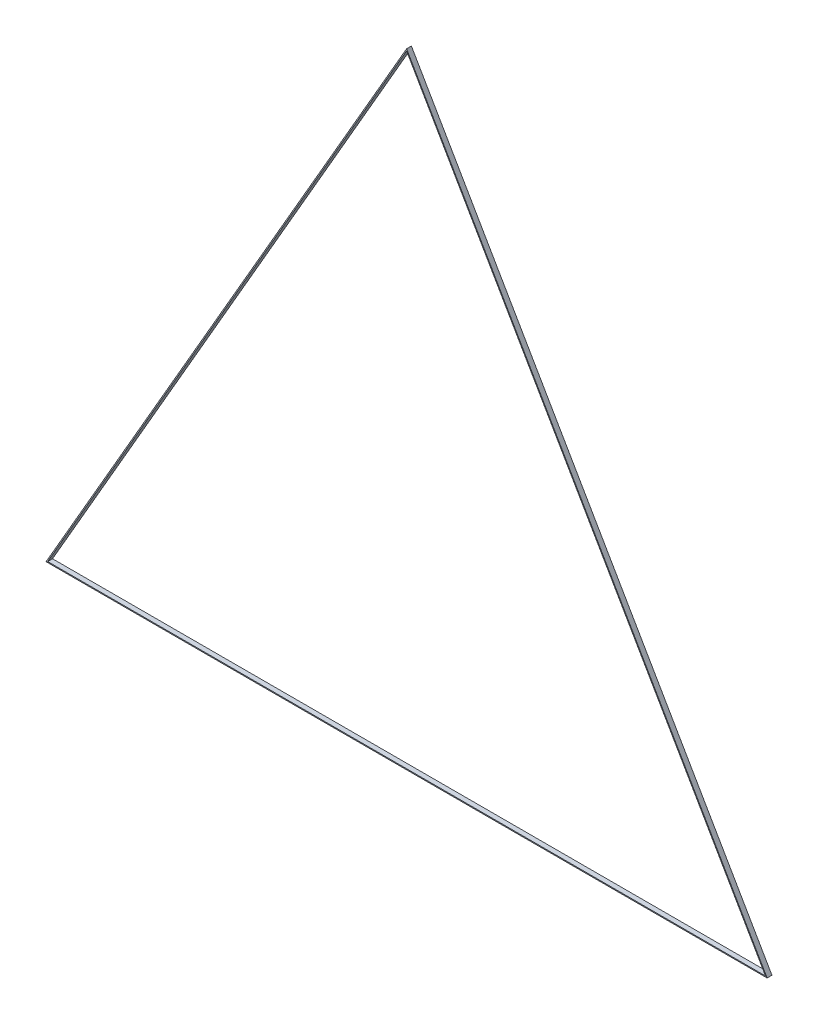
ISO-10303-21;
HEADER;
FILE_DESCRIPTION(('STEP AP214'),'2;1');
FILE_NAME('part.step','',(''),(''),'','','');
FILE_SCHEMA(('AUTOMOTIVE_DESIGN { 1 0 10303 214 1 1 1 1 }'));
ENDSEC;
DATA;
#1=APPLICATION_CONTEXT('core data for automotive mechanical design processes');
#2=APPLICATION_PROTOCOL_DEFINITION('international standard','automotive_design',2000,#1);
#3=PRODUCT_CONTEXT('',#1,'mechanical');
#4=PRODUCT('Part','Part','',(#3));
#5=PRODUCT_RELATED_PRODUCT_CATEGORY('part','',(#4));
#6=PRODUCT_DEFINITION_FORMATION('','',#4);
#7=PRODUCT_DEFINITION_CONTEXT('part definition',#1,'design');
#8=PRODUCT_DEFINITION('design','',#6,#7);
#9=PRODUCT_DEFINITION_SHAPE('','',#8);
#10=(LENGTH_UNIT() NAMED_UNIT(*) SI_UNIT(.MILLI.,.METRE.));
#11=(NAMED_UNIT(*) PLANE_ANGLE_UNIT() SI_UNIT($,.RADIAN.));
#12=(NAMED_UNIT(*) SI_UNIT($,.STERADIAN.) SOLID_ANGLE_UNIT());
#13=UNCERTAINTY_MEASURE_WITH_UNIT(LENGTH_MEASURE(1.E-05),#10,'distance_accuracy_value','');
#14=(GEOMETRIC_REPRESENTATION_CONTEXT(3) GLOBAL_UNCERTAINTY_ASSIGNED_CONTEXT((#13)) GLOBAL_UNIT_ASSIGNED_CONTEXT((#10,
#11,#12)) REPRESENTATION_CONTEXT('',''));
#15=CARTESIAN_POINT('',(0.,0.,0.));
#16=DIRECTION('',(0.,0.,1.));
#17=DIRECTION('',(1.,0.,0.));
#18=AXIS2_PLACEMENT_3D('',#15,#16,#17);
#19=CARTESIAN_POINT('',(750.,2.44929359829471E-13,10.));
#20=DIRECTION('',(0.,1.,0.));
#21=DIRECTION('',(-1.,0.,0.));
#22=AXIS2_PLACEMENT_3D('',#19,#20,#21);
#23=PLANE('',#22);
#24=DIRECTION('',(1.,0.,0.));
#25=VECTOR('',#24,1.);
#26=CARTESIAN_POINT('',(750.,2.44929359829471E-13,0.));
#27=LINE('',#26,#25);
#28=CARTESIAN_POINT('',(-750.,-2.14313189850787E-13,0.));
#29=VERTEX_POINT('',#28);
#30=CARTESIAN_POINT('',(750.,2.44929359829471E-13,0.));
#31=VERTEX_POINT('',#30);
#32=EDGE_CURVE('E111',#29,#31,#27,.T.);
#33=ORIENTED_EDGE('',*,*,#32,.T.);
#34=DIRECTION('',(0.,0.,-1.));
#35=VECTOR('',#34,1.);
#36=CARTESIAN_POINT('',(750.,2.44929359829471E-13,10.));
#37=LINE('',#36,#35);
#38=CARTESIAN_POINT('',(750.,2.44929359829471E-13,10.));
#39=VERTEX_POINT('',#38);
#40=EDGE_CURVE('E11',#39,#31,#37,.T.);
#41=ORIENTED_EDGE('',*,*,#40,.F.);
#42=DIRECTION('',(1.,0.,0.));
#43=VECTOR('',#42,1.);
#44=CARTESIAN_POINT('',(750.,2.44929359829471E-13,10.));
#45=LINE('',#44,#43);
#46=CARTESIAN_POINT('',(-750.,-2.14313189850787E-13,10.));
#47=VERTEX_POINT('',#46);
#48=EDGE_CURVE('E113',#47,#39,#45,.T.);
#49=ORIENTED_EDGE('',*,*,#48,.F.);
#50=DIRECTION('',(0.,0.,-1.));
#51=VECTOR('',#50,1.);
#52=CARTESIAN_POINT('',(-750.,-2.14313189850787E-13,10.));
#53=LINE('',#52,#51);
#54=EDGE_CURVE('E121',#47,#29,#53,.T.);
#55=ORIENTED_EDGE('',*,*,#54,.T.);
#56=EDGE_LOOP('',(#33,#41,#49,#55));
#57=FACE_BOUND('',#56,.T.);
#58=ADVANCED_FACE('F33',(#57),#23,.F.);
#59=CARTESIAN_POINT('',(-3.88578058618805E-13,1299.03810567666,10.));
#60=DIRECTION('',(-0.866025403784438,-0.500000000000001,0.));
#61=DIRECTION('',(0.500000000000001,-0.866025403784438,0.));
#62=AXIS2_PLACEMENT_3D('',#59,#60,#61);
#63=PLANE('',#62);
#64=DIRECTION('',(-0.500000000000001,0.866025403784438,0.));
#65=VECTOR('',#64,1.);
#66=CARTESIAN_POINT('',(-3.88578058618805E-13,1299.03810567666,0.));
#67=LINE('',#66,#65);
#68=CARTESIAN_POINT('',(-3.88578058618805E-13,1299.03810567666,0.));
#69=VERTEX_POINT('',#68);
#70=EDGE_CURVE('E124',#31,#69,#67,.T.);
#71=ORIENTED_EDGE('',*,*,#70,.T.);
#72=DIRECTION('',(0.,0.,-1.));
#73=VECTOR('',#72,1.);
#74=CARTESIAN_POINT('',(-3.88578058618805E-13,1299.03810567666,10.));
#75=LINE('',#74,#73);
#76=CARTESIAN_POINT('',(-3.88578058618805E-13,1299.03810567666,10.));
#77=VERTEX_POINT('',#76);
#78=EDGE_CURVE('E40',#77,#69,#75,.T.);
#79=ORIENTED_EDGE('',*,*,#78,.F.);
#80=DIRECTION('',(-0.500000000000001,0.866025403784438,0.));
#81=VECTOR('',#80,1.);
#82=CARTESIAN_POINT('',(-3.88578058618805E-13,1299.03810567666,10.));
#83=LINE('',#82,#81);
#84=EDGE_CURVE('E116',#39,#77,#83,.T.);
#85=ORIENTED_EDGE('',*,*,#84,.F.);
#86=ORIENTED_EDGE('',*,*,#40,.T.);
#87=EDGE_LOOP('',(#71,#79,#85,#86));
#88=FACE_BOUND('',#87,.T.);
#89=ADVANCED_FACE('F142',(#88),#63,.F.);
#90=CARTESIAN_POINT('',(-750.,-2.14313189850787E-13,10.));
#91=DIRECTION('',(0.866025403784439,-0.5,0.));
#92=DIRECTION('',(0.5,0.866025403784439,0.));
#93=AXIS2_PLACEMENT_3D('',#90,#91,#92);
#94=PLANE('',#93);
#95=DIRECTION('',(-0.5,-0.866025403784439,0.));
#96=VECTOR('',#95,1.);
#97=CARTESIAN_POINT('',(-750.,-2.14313189850787E-13,0.));
#98=LINE('',#97,#96);
#99=EDGE_CURVE('E117',#69,#29,#98,.T.);
#100=ORIENTED_EDGE('',*,*,#99,.T.);
#101=ORIENTED_EDGE('',*,*,#54,.F.);
#102=DIRECTION('',(-0.5,-0.866025403784439,0.));
#103=VECTOR('',#102,1.);
#104=CARTESIAN_POINT('',(-750.,-2.14313189850787E-13,10.));
#105=LINE('',#104,#103);
#106=EDGE_CURVE('E119',#77,#47,#105,.T.);
#107=ORIENTED_EDGE('',*,*,#106,.F.);
#108=ORIENTED_EDGE('',*,*,#78,.T.);
#109=EDGE_LOOP('',(#100,#101,#107,#108));
#110=FACE_BOUND('',#109,.T.);
#111=ADVANCED_FACE('F133',(#110),#94,.F.);
#112=CARTESIAN_POINT('',(0.,0.,10.));
#113=DIRECTION('',(0.,0.,-1.));
#114=DIRECTION('',(-1.,0.,0.));
#115=AXIS2_PLACEMENT_3D('',#112,#113,#114);
#116=PLANE('',#115);
#117=DIRECTION('',(-0.5,0.866025403784439,0.));
#118=VECTOR('',#117,1.);
#119=CARTESIAN_POINT('',(0.,1295.03810567666,10.));
#120=LINE('',#119,#118);
#121=CARTESIAN_POINT('',(746.535898384863,1.99999999999978,10.));
#122=VERTEX_POINT('',#121);
#123=CARTESIAN_POINT('',(0.,1295.03810567666,10.));
#124=VERTEX_POINT('',#123);
#125=EDGE_CURVE('E103',#122,#124,#120,.T.);
#126=ORIENTED_EDGE('',*,*,#125,.F.);
#127=DIRECTION('',(1.,0.,0.));
#128=VECTOR('',#127,1.);
#129=CARTESIAN_POINT('',(746.535898384863,1.99999999999972,10.));
#130=LINE('',#129,#128);
#131=CARTESIAN_POINT('',(-746.535898384863,1.99999999999954,10.));
#132=VERTEX_POINT('',#131);
#133=EDGE_CURVE('E47',#132,#122,#130,.T.);
#134=ORIENTED_EDGE('',*,*,#133,.F.);
#135=DIRECTION('',(-0.5,-0.866025403784438,0.));
#136=VECTOR('',#135,1.);
#137=CARTESIAN_POINT('',(-746.535898384863,1.99999999999954,10.));
#138=LINE('',#137,#136);
#139=EDGE_CURVE('E100',#124,#132,#138,.T.);
#140=ORIENTED_EDGE('',*,*,#139,.F.);
#141=EDGE_LOOP('',(#126,#134,#140));
#142=FACE_BOUND('',#141,.T.);
#143=ORIENTED_EDGE('',*,*,#48,.T.);
#144=ORIENTED_EDGE('',*,*,#84,.T.);
#145=ORIENTED_EDGE('',*,*,#106,.T.);
#146=EDGE_LOOP('',(#143,#144,#145));
#147=FACE_BOUND('',#146,.T.);
#148=ADVANCED_FACE('F141',(#142,#147),#116,.F.);
#149=CARTESIAN_POINT('',(0.,0.,0.));
#150=DIRECTION('',(0.,0.,-1.));
#151=DIRECTION('',(-1.,0.,0.));
#152=AXIS2_PLACEMENT_3D('',#149,#150,#151);
#153=PLANE('',#152);
#154=DIRECTION('',(1.,0.,0.));
#155=VECTOR('',#154,1.);
#156=CARTESIAN_POINT('',(746.535898384863,1.99999999999972,0.));
#157=LINE('',#156,#155);
#158=CARTESIAN_POINT('',(-746.535898384863,1.99999999999954,0.));
#159=VERTEX_POINT('',#158);
#160=CARTESIAN_POINT('',(746.535898384863,1.99999999999972,0.));
#161=VERTEX_POINT('',#160);
#162=EDGE_CURVE('E87',#159,#161,#157,.T.);
#163=ORIENTED_EDGE('',*,*,#162,.T.);
#164=DIRECTION('',(-0.5,0.866025403784439,0.));
#165=VECTOR('',#164,1.);
#166=CARTESIAN_POINT('',(0.,1295.03810567666,0.));
#167=LINE('',#166,#165);
#168=CARTESIAN_POINT('',(1.11022302462516E-13,1295.03810567666,0.));
#169=VERTEX_POINT('',#168);
#170=EDGE_CURVE('E94',#161,#169,#167,.T.);
#171=ORIENTED_EDGE('',*,*,#170,.T.);
#172=DIRECTION('',(-0.5,-0.866025403784438,0.));
#173=VECTOR('',#172,1.);
#174=CARTESIAN_POINT('',(-746.535898384863,1.99999999999954,0.));
#175=LINE('',#174,#173);
#176=EDGE_CURVE('E55',#169,#159,#175,.T.);
#177=ORIENTED_EDGE('',*,*,#176,.T.);
#178=EDGE_LOOP('',(#163,#171,#177));
#179=FACE_BOUND('',#178,.T.);
#180=ORIENTED_EDGE('',*,*,#32,.F.);
#181=ORIENTED_EDGE('',*,*,#99,.F.);
#182=ORIENTED_EDGE('',*,*,#70,.F.);
#183=EDGE_LOOP('',(#180,#181,#182));
#184=FACE_BOUND('',#183,.T.);
#185=ADVANCED_FACE('F98',(#179,#184),#153,.T.);
#186=CARTESIAN_POINT('',(746.535898384863,1.99999999999972,0.));
#187=DIRECTION('',(0.,-1.,0.));
#188=DIRECTION('',(1.,0.,0.));
#189=AXIS2_PLACEMENT_3D('',#186,#187,#188);
#190=PLANE('',#189);
#191=ORIENTED_EDGE('',*,*,#133,.T.);
#192=DIRECTION('',(0.,0.,1.));
#193=VECTOR('',#192,1.);
#194=CARTESIAN_POINT('',(746.535898384863,1.99999999999972,0.));
#195=LINE('',#194,#193);
#196=EDGE_CURVE('E83',#161,#122,#195,.T.);
#197=ORIENTED_EDGE('',*,*,#196,.F.);
#198=ORIENTED_EDGE('',*,*,#162,.F.);
#199=DIRECTION('',(0.,0.,1.));
#200=VECTOR('',#199,1.);
#201=CARTESIAN_POINT('',(-746.535898384863,1.99999999999954,0.));
#202=LINE('',#201,#200);
#203=EDGE_CURVE('E109',#159,#132,#202,.T.);
#204=ORIENTED_EDGE('',*,*,#203,.T.);
#205=EDGE_LOOP('',(#191,#197,#198,#204));
#206=FACE_BOUND('',#205,.T.);
#207=ADVANCED_FACE('F85',(#206),#190,.F.);
#208=CARTESIAN_POINT('',(-746.535898384863,1.99999999999954,0.));
#209=DIRECTION('',(-0.866025403784439,0.5,0.));
#210=DIRECTION('',(-0.5,-0.866025403784439,0.));
#211=AXIS2_PLACEMENT_3D('',#208,#209,#210);
#212=PLANE('',#211);
#213=ORIENTED_EDGE('',*,*,#139,.T.);
#214=ORIENTED_EDGE('',*,*,#203,.F.);
#215=ORIENTED_EDGE('',*,*,#176,.F.);
#216=DIRECTION('',(0.,0.,1.));
#217=VECTOR('',#216,1.);
#218=CARTESIAN_POINT('',(0.,1295.03810567666,0.));
#219=LINE('',#218,#217);
#220=EDGE_CURVE('E91',#169,#124,#219,.T.);
#221=ORIENTED_EDGE('',*,*,#220,.T.);
#222=EDGE_LOOP('',(#213,#214,#215,#221));
#223=FACE_BOUND('',#222,.T.);
#224=ADVANCED_FACE('F157',(#223),#212,.F.);
#225=CARTESIAN_POINT('',(0.,1295.03810567666,0.));
#226=DIRECTION('',(0.866025403784439,0.5,0.));
#227=DIRECTION('',(-0.5,0.866025403784439,0.));
#228=AXIS2_PLACEMENT_3D('',#225,#226,#227);
#229=PLANE('',#228);
#230=ORIENTED_EDGE('',*,*,#125,.T.);
#231=ORIENTED_EDGE('',*,*,#220,.F.);
#232=ORIENTED_EDGE('',*,*,#170,.F.);
#233=ORIENTED_EDGE('',*,*,#196,.T.);
#234=EDGE_LOOP('',(#230,#231,#232,#233));
#235=FACE_BOUND('',#234,.T.);
#236=ADVANCED_FACE('F95',(#235),#229,.F.);
#237=CLOSED_SHELL('',(#58,#89,#111,#148,#185,#207,#224,#236));
#238=MANIFOLD_SOLID_BREP('B2',#237);
#239=ADVANCED_BREP_SHAPE_REPRESENTATION('',(#18,#238),#14);
#240=SHAPE_DEFINITION_REPRESENTATION(#9,#239);
ENDSEC;
END-ISO-10303-21;
